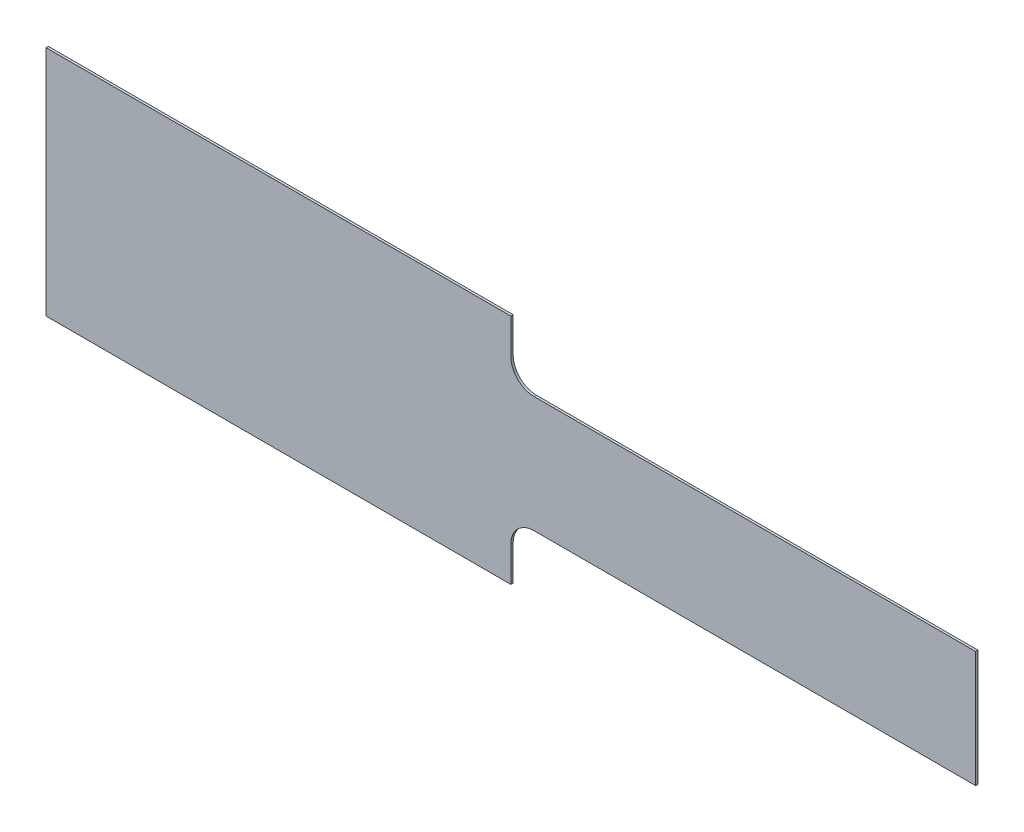
ISO-10303-21;
HEADER;
FILE_DESCRIPTION(('STEP AP214'),'2;1');
FILE_NAME('part.step','',(''),(''),'','','');
FILE_SCHEMA(('AUTOMOTIVE_DESIGN { 1 0 10303 214 1 1 1 1 }'));
ENDSEC;
DATA;
#1=APPLICATION_CONTEXT('core data for automotive mechanical design processes');
#2=APPLICATION_PROTOCOL_DEFINITION('international standard','automotive_design',2000,#1);
#3=PRODUCT_CONTEXT('',#1,'mechanical');
#4=PRODUCT('Part','Part','',(#3));
#5=PRODUCT_RELATED_PRODUCT_CATEGORY('part','',(#4));
#6=PRODUCT_DEFINITION_FORMATION('','',#4);
#7=PRODUCT_DEFINITION_CONTEXT('part definition',#1,'design');
#8=PRODUCT_DEFINITION('design','',#6,#7);
#9=PRODUCT_DEFINITION_SHAPE('','',#8);
#10=(LENGTH_UNIT() NAMED_UNIT(*) SI_UNIT(.MILLI.,.METRE.));
#11=(NAMED_UNIT(*) PLANE_ANGLE_UNIT() SI_UNIT($,.RADIAN.));
#12=(NAMED_UNIT(*) SI_UNIT($,.STERADIAN.) SOLID_ANGLE_UNIT());
#13=UNCERTAINTY_MEASURE_WITH_UNIT(LENGTH_MEASURE(1.E-05),#10,'distance_accuracy_value','');
#14=(GEOMETRIC_REPRESENTATION_CONTEXT(3) GLOBAL_UNCERTAINTY_ASSIGNED_CONTEXT((#13)) GLOBAL_UNIT_ASSIGNED_CONTEXT((#10,
#11,#12)) REPRESENTATION_CONTEXT('',''));
#15=CARTESIAN_POINT('',(0.,0.,0.));
#16=DIRECTION('',(0.,0.,1.));
#17=DIRECTION('',(1.,0.,0.));
#18=AXIS2_PLACEMENT_3D('',#15,#16,#17);
#19=CARTESIAN_POINT('',(0.,50.,1.));
#20=DIRECTION('',(1.,0.,0.));
#21=DIRECTION('',(0.,1.,0.));
#22=AXIS2_PLACEMENT_3D('',#19,#20,#21);
#23=PLANE('',#22);
#24=DIRECTION('',(0.,-1.,0.));
#25=VECTOR('',#24,1.);
#26=CARTESIAN_POINT('',(0.,50.,0.));
#27=LINE('',#26,#25);
#28=CARTESIAN_POINT('',(0.,50.,0.));
#29=VERTEX_POINT('',#28);
#30=CARTESIAN_POINT('',(0.,-50.,0.));
#31=VERTEX_POINT('',#30);
#32=EDGE_CURVE('E143',#29,#31,#27,.T.);
#33=ORIENTED_EDGE('',*,*,#32,.T.);
#34=DIRECTION('',(0.,0.,-1.));
#35=VECTOR('',#34,1.);
#36=CARTESIAN_POINT('',(0.,-50.,1.));
#37=LINE('',#36,#35);
#38=CARTESIAN_POINT('',(0.,-50.,1.));
#39=VERTEX_POINT('',#38);
#40=EDGE_CURVE('E11',#39,#31,#37,.T.);
#41=ORIENTED_EDGE('',*,*,#40,.F.);
#42=DIRECTION('',(0.,-1.,0.));
#43=VECTOR('',#42,1.);
#44=CARTESIAN_POINT('',(0.,50.,1.));
#45=LINE('',#44,#43);
#46=CARTESIAN_POINT('',(0.,50.,1.));
#47=VERTEX_POINT('',#46);
#48=EDGE_CURVE('E161',#47,#39,#45,.T.);
#49=ORIENTED_EDGE('',*,*,#48,.F.);
#50=DIRECTION('',(0.,0.,-1.));
#51=VECTOR('',#50,1.);
#52=CARTESIAN_POINT('',(0.,50.,1.));
#53=LINE('',#52,#51);
#54=EDGE_CURVE('E139',#47,#29,#53,.T.);
#55=ORIENTED_EDGE('',*,*,#54,.T.);
#56=EDGE_LOOP('',(#33,#41,#49,#55));
#57=FACE_BOUND('',#56,.T.);
#58=ADVANCED_FACE('F35',(#57),#23,.F.);
#59=CARTESIAN_POINT('',(0.,-50.,1.));
#60=DIRECTION('',(0.,1.,0.));
#61=DIRECTION('',(-1.,0.,0.));
#62=AXIS2_PLACEMENT_3D('',#59,#60,#61);
#63=PLANE('',#62);
#64=DIRECTION('',(1.,0.,0.));
#65=VECTOR('',#64,1.);
#66=CARTESIAN_POINT('',(0.,-50.,0.));
#67=LINE('',#66,#65);
#68=CARTESIAN_POINT('',(200.,-50.,0.));
#69=VERTEX_POINT('',#68);
#70=EDGE_CURVE('E146',#31,#69,#67,.T.);
#71=ORIENTED_EDGE('',*,*,#70,.T.);
#72=DIRECTION('',(0.,0.,-1.));
#73=VECTOR('',#72,1.);
#74=CARTESIAN_POINT('',(200.,-50.,1.));
#75=LINE('',#74,#73);
#76=CARTESIAN_POINT('',(200.,-50.,1.));
#77=VERTEX_POINT('',#76);
#78=EDGE_CURVE('E43',#77,#69,#75,.T.);
#79=ORIENTED_EDGE('',*,*,#78,.F.);
#80=DIRECTION('',(1.,0.,0.));
#81=VECTOR('',#80,1.);
#82=CARTESIAN_POINT('',(0.,-50.,1.));
#83=LINE('',#82,#81);
#84=EDGE_CURVE('E100',#39,#77,#83,.T.);
#85=ORIENTED_EDGE('',*,*,#84,.F.);
#86=ORIENTED_EDGE('',*,*,#40,.T.);
#87=EDGE_LOOP('',(#71,#79,#85,#86));
#88=FACE_BOUND('',#87,.T.);
#89=ADVANCED_FACE('F210',(#88),#63,.F.);
#90=CARTESIAN_POINT('',(200.,-35.,1.));
#91=DIRECTION('',(-1.,0.,0.));
#92=DIRECTION('',(0.,0.,1.));
#93=AXIS2_PLACEMENT_3D('',#90,#91,#92);
#94=PLANE('',#93);
#95=DIRECTION('',(0.,1.,0.));
#96=VECTOR('',#95,1.);
#97=CARTESIAN_POINT('',(200.,-35.,0.));
#98=LINE('',#97,#96);
#99=CARTESIAN_POINT('',(200.,-35.,0.));
#100=VERTEX_POINT('',#99);
#101=EDGE_CURVE('E148',#69,#100,#98,.T.);
#102=ORIENTED_EDGE('',*,*,#101,.T.);
#103=DIRECTION('',(0.,0.,-1.));
#104=VECTOR('',#103,1.);
#105=CARTESIAN_POINT('',(200.,-35.,1.));
#106=LINE('',#105,#104);
#107=CARTESIAN_POINT('',(200.,-35.,1.));
#108=VERTEX_POINT('',#107);
#109=EDGE_CURVE('E174',#108,#100,#106,.T.);
#110=ORIENTED_EDGE('',*,*,#109,.F.);
#111=DIRECTION('',(0.,1.,0.));
#112=VECTOR('',#111,1.);
#113=CARTESIAN_POINT('',(200.,-35.,1.));
#114=LINE('',#113,#112);
#115=EDGE_CURVE('E182',#77,#108,#114,.T.);
#116=ORIENTED_EDGE('',*,*,#115,.F.);
#117=ORIENTED_EDGE('',*,*,#78,.T.);
#118=EDGE_LOOP('',(#102,#110,#116,#117));
#119=FACE_BOUND('',#118,.T.);
#120=ADVANCED_FACE('F180',(#119),#94,.F.);
#121=CARTESIAN_POINT('',(210.,-35.,1.));
#122=DIRECTION('',(0.,0.,-1.));
#123=DIRECTION('',(-1.,0.,0.));
#124=AXIS2_PLACEMENT_3D('',#121,#122,#123);
#125=CYLINDRICAL_SURFACE('',#124,9.99999999999999);
#126=CARTESIAN_POINT('',(210.,-35.,0.));
#127=DIRECTION('',(0.,0.,-1.));
#128=DIRECTION('',(-1.,0.,0.));
#129=AXIS2_PLACEMENT_3D('',#126,#127,#128);
#130=CIRCLE('',#129,9.99999999999999);
#131=CARTESIAN_POINT('',(210.,-25.,0.));
#132=VERTEX_POINT('',#131);
#133=EDGE_CURVE('E150',#100,#132,#130,.T.);
#134=ORIENTED_EDGE('',*,*,#133,.T.);
#135=DIRECTION('',(0.,0.,-1.));
#136=VECTOR('',#135,1.);
#137=CARTESIAN_POINT('',(210.,-25.,1.));
#138=LINE('',#137,#136);
#139=CARTESIAN_POINT('',(210.,-25.,1.));
#140=VERTEX_POINT('',#139);
#141=EDGE_CURVE('E171',#140,#132,#138,.T.);
#142=ORIENTED_EDGE('',*,*,#141,.F.);
#143=CARTESIAN_POINT('',(210.,-35.,1.));
#144=DIRECTION('',(0.,0.,-1.));
#145=DIRECTION('',(-1.,0.,0.));
#146=AXIS2_PLACEMENT_3D('',#143,#144,#145);
#147=CIRCLE('',#146,9.99999999999999);
#148=EDGE_CURVE('E200',#108,#140,#147,.T.);
#149=ORIENTED_EDGE('',*,*,#148,.F.);
#150=ORIENTED_EDGE('',*,*,#109,.T.);
#151=EDGE_LOOP('',(#134,#142,#149,#150));
#152=FACE_BOUND('',#151,.T.);
#153=ADVANCED_FACE('F191',(#152),#125,.F.);
#154=CARTESIAN_POINT('',(210.,-25.,1.));
#155=DIRECTION('',(0.,1.,0.));
#156=DIRECTION('',(0.,0.,1.));
#157=AXIS2_PLACEMENT_3D('',#154,#155,#156);
#158=PLANE('',#157);
#159=DIRECTION('',(1.,0.,0.));
#160=VECTOR('',#159,1.);
#161=CARTESIAN_POINT('',(210.,-25.,0.));
#162=LINE('',#161,#160);
#163=CARTESIAN_POINT('',(400.,-25.,0.));
#164=VERTEX_POINT('',#163);
#165=EDGE_CURVE('E152',#132,#164,#162,.T.);
#166=ORIENTED_EDGE('',*,*,#165,.T.);
#167=DIRECTION('',(0.,0.,-1.));
#168=VECTOR('',#167,1.);
#169=CARTESIAN_POINT('',(400.,-25.,1.));
#170=LINE('',#169,#168);
#171=CARTESIAN_POINT('',(400.,-25.,1.));
#172=VERTEX_POINT('',#171);
#173=EDGE_CURVE('E168',#172,#164,#170,.T.);
#174=ORIENTED_EDGE('',*,*,#173,.F.);
#175=DIRECTION('',(1.,0.,0.));
#176=VECTOR('',#175,1.);
#177=CARTESIAN_POINT('',(210.,-25.,1.));
#178=LINE('',#177,#176);
#179=EDGE_CURVE('E197',#140,#172,#178,.T.);
#180=ORIENTED_EDGE('',*,*,#179,.F.);
#181=ORIENTED_EDGE('',*,*,#141,.T.);
#182=EDGE_LOOP('',(#166,#174,#180,#181));
#183=FACE_BOUND('',#182,.T.);
#184=ADVANCED_FACE('F195',(#183),#158,.F.);
#185=CARTESIAN_POINT('',(400.,25.,1.));
#186=DIRECTION('',(-1.,0.,0.));
#187=DIRECTION('',(0.,0.,1.));
#188=AXIS2_PLACEMENT_3D('',#185,#186,#187);
#189=PLANE('',#188);
#190=DIRECTION('',(0.,1.,0.));
#191=VECTOR('',#190,1.);
#192=CARTESIAN_POINT('',(400.,25.,0.));
#193=LINE('',#192,#191);
#194=CARTESIAN_POINT('',(400.,25.,0.));
#195=VERTEX_POINT('',#194);
#196=EDGE_CURVE('E154',#164,#195,#193,.T.);
#197=ORIENTED_EDGE('',*,*,#196,.T.);
#198=DIRECTION('',(0.,0.,-1.));
#199=VECTOR('',#198,1.);
#200=CARTESIAN_POINT('',(400.,25.,1.));
#201=LINE('',#200,#199);
#202=CARTESIAN_POINT('',(400.,25.,1.));
#203=VERTEX_POINT('',#202);
#204=EDGE_CURVE('E165',#203,#195,#201,.T.);
#205=ORIENTED_EDGE('',*,*,#204,.F.);
#206=DIRECTION('',(0.,1.,0.));
#207=VECTOR('',#206,1.);
#208=CARTESIAN_POINT('',(400.,25.,1.));
#209=LINE('',#208,#207);
#210=EDGE_CURVE('E199',#172,#203,#209,.T.);
#211=ORIENTED_EDGE('',*,*,#210,.F.);
#212=ORIENTED_EDGE('',*,*,#173,.T.);
#213=EDGE_LOOP('',(#197,#205,#211,#212));
#214=FACE_BOUND('',#213,.T.);
#215=ADVANCED_FACE('F222',(#214),#189,.F.);
#216=CARTESIAN_POINT('',(210.,25.,1.));
#217=DIRECTION('',(0.,-1.,0.));
#218=DIRECTION('',(0.,0.,-1.));
#219=AXIS2_PLACEMENT_3D('',#216,#217,#218);
#220=PLANE('',#219);
#221=DIRECTION('',(-1.,0.,0.));
#222=VECTOR('',#221,1.);
#223=CARTESIAN_POINT('',(210.,25.,0.));
#224=LINE('',#223,#222);
#225=CARTESIAN_POINT('',(210.,25.,0.));
#226=VERTEX_POINT('',#225);
#227=EDGE_CURVE('E156',#195,#226,#224,.T.);
#228=ORIENTED_EDGE('',*,*,#227,.T.);
#229=DIRECTION('',(0.,0.,-1.));
#230=VECTOR('',#229,1.);
#231=CARTESIAN_POINT('',(210.,25.,1.));
#232=LINE('',#231,#230);
#233=CARTESIAN_POINT('',(210.,25.,1.));
#234=VERTEX_POINT('',#233);
#235=EDGE_CURVE('E134',#234,#226,#232,.T.);
#236=ORIENTED_EDGE('',*,*,#235,.F.);
#237=DIRECTION('',(-1.,0.,0.));
#238=VECTOR('',#237,1.);
#239=CARTESIAN_POINT('',(210.,25.,1.));
#240=LINE('',#239,#238);
#241=EDGE_CURVE('E125',#203,#234,#240,.T.);
#242=ORIENTED_EDGE('',*,*,#241,.F.);
#243=ORIENTED_EDGE('',*,*,#204,.T.);
#244=EDGE_LOOP('',(#228,#236,#242,#243));
#245=FACE_BOUND('',#244,.T.);
#246=ADVANCED_FACE('F225',(#245),#220,.F.);
#247=CARTESIAN_POINT('',(210.,35.,1.));
#248=DIRECTION('',(0.,0.,-1.));
#249=DIRECTION('',(-1.,0.,0.));
#250=AXIS2_PLACEMENT_3D('',#247,#248,#249);
#251=CYLINDRICAL_SURFACE('',#250,9.99999999999999);
#252=CARTESIAN_POINT('',(210.,35.,0.));
#253=DIRECTION('',(0.,0.,-1.));
#254=DIRECTION('',(-1.,0.,0.));
#255=AXIS2_PLACEMENT_3D('',#252,#253,#254);
#256=CIRCLE('',#255,9.99999999999999);
#257=CARTESIAN_POINT('',(200.,35.,0.));
#258=VERTEX_POINT('',#257);
#259=EDGE_CURVE('E133',#226,#258,#256,.T.);
#260=ORIENTED_EDGE('',*,*,#259,.T.);
#261=DIRECTION('',(0.,0.,-1.));
#262=VECTOR('',#261,1.);
#263=CARTESIAN_POINT('',(200.,35.,1.));
#264=LINE('',#263,#262);
#265=CARTESIAN_POINT('',(200.,35.,1.));
#266=VERTEX_POINT('',#265);
#267=EDGE_CURVE('E130',#266,#258,#264,.T.);
#268=ORIENTED_EDGE('',*,*,#267,.F.);
#269=CARTESIAN_POINT('',(210.,35.,1.));
#270=DIRECTION('',(0.,0.,-1.));
#271=DIRECTION('',(-1.,0.,0.));
#272=AXIS2_PLACEMENT_3D('',#269,#270,#271);
#273=CIRCLE('',#272,9.99999999999999);
#274=EDGE_CURVE('E119',#234,#266,#273,.T.);
#275=ORIENTED_EDGE('',*,*,#274,.F.);
#276=ORIENTED_EDGE('',*,*,#235,.T.);
#277=EDGE_LOOP('',(#260,#268,#275,#276));
#278=FACE_BOUND('',#277,.T.);
#279=ADVANCED_FACE('F131',(#278),#251,.F.);
#280=CARTESIAN_POINT('',(200.,50.,1.));
#281=DIRECTION('',(-1.,0.,0.));
#282=DIRECTION('',(0.,0.,1.));
#283=AXIS2_PLACEMENT_3D('',#280,#281,#282);
#284=PLANE('',#283);
#285=DIRECTION('',(0.,1.,0.));
#286=VECTOR('',#285,1.);
#287=CARTESIAN_POINT('',(200.,50.,0.));
#288=LINE('',#287,#286);
#289=CARTESIAN_POINT('',(200.,50.,0.));
#290=VERTEX_POINT('',#289);
#291=EDGE_CURVE('E86',#258,#290,#288,.T.);
#292=ORIENTED_EDGE('',*,*,#291,.T.);
#293=DIRECTION('',(0.,0.,-1.));
#294=VECTOR('',#293,1.);
#295=CARTESIAN_POINT('',(200.,50.,1.));
#296=LINE('',#295,#294);
#297=CARTESIAN_POINT('',(200.,50.,1.));
#298=VERTEX_POINT('',#297);
#299=EDGE_CURVE('E135',#298,#290,#296,.T.);
#300=ORIENTED_EDGE('',*,*,#299,.F.);
#301=DIRECTION('',(0.,1.,0.));
#302=VECTOR('',#301,1.);
#303=CARTESIAN_POINT('',(200.,50.,1.));
#304=LINE('',#303,#302);
#305=EDGE_CURVE('E123',#266,#298,#304,.T.);
#306=ORIENTED_EDGE('',*,*,#305,.F.);
#307=ORIENTED_EDGE('',*,*,#267,.T.);
#308=EDGE_LOOP('',(#292,#300,#306,#307));
#309=FACE_BOUND('',#308,.T.);
#310=ADVANCED_FACE('F137',(#309),#284,.F.);
#311=CARTESIAN_POINT('',(0.,50.,1.));
#312=DIRECTION('',(0.,-1.,0.));
#313=DIRECTION('',(1.,0.,0.));
#314=AXIS2_PLACEMENT_3D('',#311,#312,#313);
#315=PLANE('',#314);
#316=DIRECTION('',(-1.,0.,0.));
#317=VECTOR('',#316,1.);
#318=CARTESIAN_POINT('',(0.,50.,0.));
#319=LINE('',#318,#317);
#320=EDGE_CURVE('E92',#290,#29,#319,.T.);
#321=ORIENTED_EDGE('',*,*,#320,.T.);
#322=ORIENTED_EDGE('',*,*,#54,.F.);
#323=DIRECTION('',(-1.,0.,0.));
#324=VECTOR('',#323,1.);
#325=CARTESIAN_POINT('',(0.,50.,1.));
#326=LINE('',#325,#324);
#327=EDGE_CURVE('E51',#298,#47,#326,.T.);
#328=ORIENTED_EDGE('',*,*,#327,.F.);
#329=ORIENTED_EDGE('',*,*,#299,.T.);
#330=EDGE_LOOP('',(#321,#322,#328,#329));
#331=FACE_BOUND('',#330,.T.);
#332=ADVANCED_FACE('F234',(#331),#315,.F.);
#333=CARTESIAN_POINT('',(210.,-35.,1.));
#334=DIRECTION('',(0.,0.,-1.));
#335=DIRECTION('',(-1.,0.,0.));
#336=AXIS2_PLACEMENT_3D('',#333,#334,#335);
#337=PLANE('',#336);
#338=ORIENTED_EDGE('',*,*,#48,.T.);
#339=ORIENTED_EDGE('',*,*,#84,.T.);
#340=ORIENTED_EDGE('',*,*,#115,.T.);
#341=ORIENTED_EDGE('',*,*,#148,.T.);
#342=ORIENTED_EDGE('',*,*,#179,.T.);
#343=ORIENTED_EDGE('',*,*,#210,.T.);
#344=ORIENTED_EDGE('',*,*,#241,.T.);
#345=ORIENTED_EDGE('',*,*,#274,.T.);
#346=ORIENTED_EDGE('',*,*,#305,.T.);
#347=ORIENTED_EDGE('',*,*,#327,.T.);
#348=EDGE_LOOP('',(#338,#339,#340,#341,#342,#343,#344,#345,#346,#347));
#349=FACE_BOUND('',#348,.T.);
#350=ADVANCED_FACE('F121',(#349),#337,.F.);
#351=CARTESIAN_POINT('',(210.,-35.,0.));
#352=DIRECTION('',(0.,0.,-1.));
#353=DIRECTION('',(-1.,0.,0.));
#354=AXIS2_PLACEMENT_3D('',#351,#352,#353);
#355=PLANE('',#354);
#356=ORIENTED_EDGE('',*,*,#32,.F.);
#357=ORIENTED_EDGE('',*,*,#320,.F.);
#358=ORIENTED_EDGE('',*,*,#291,.F.);
#359=ORIENTED_EDGE('',*,*,#259,.F.);
#360=ORIENTED_EDGE('',*,*,#227,.F.);
#361=ORIENTED_EDGE('',*,*,#196,.F.);
#362=ORIENTED_EDGE('',*,*,#165,.F.);
#363=ORIENTED_EDGE('',*,*,#133,.F.);
#364=ORIENTED_EDGE('',*,*,#101,.F.);
#365=ORIENTED_EDGE('',*,*,#70,.F.);
#366=EDGE_LOOP('',(#356,#357,#358,#359,#360,#361,#362,#363,#364,#365));
#367=FACE_BOUND('',#366,.T.);
#368=ADVANCED_FACE('F186',(#367),#355,.T.);
#369=CLOSED_SHELL('',(#58,#89,#120,#153,#184,#215,#246,#279,#310,#332,#350,#368));
#370=MANIFOLD_SOLID_BREP('B2',#369);
#371=ADVANCED_BREP_SHAPE_REPRESENTATION('',(#18,#370),#14);
#372=SHAPE_DEFINITION_REPRESENTATION(#9,#371);
ENDSEC;
END-ISO-10303-21;
